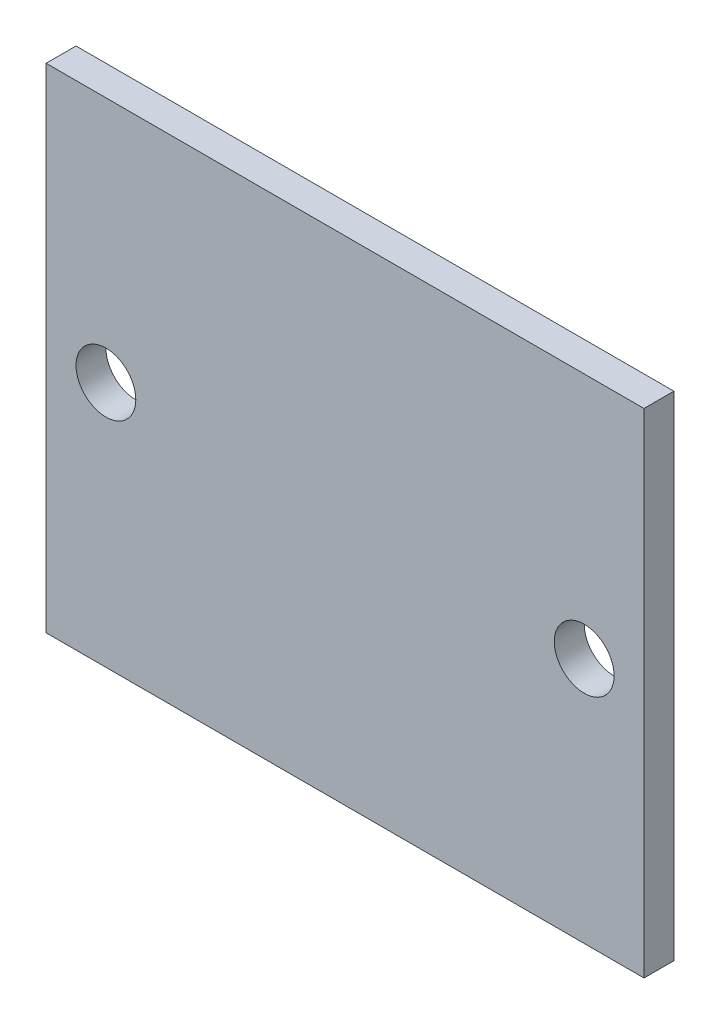
ISO-10303-21;
HEADER;
FILE_DESCRIPTION(('STEP AP214'),'2;1');
FILE_NAME('part.step','',(''),(''),'','','');
FILE_SCHEMA(('AUTOMOTIVE_DESIGN { 1 0 10303 214 1 1 1 1 }'));
ENDSEC;
DATA;
#1=APPLICATION_CONTEXT('core data for automotive mechanical design processes');
#2=APPLICATION_PROTOCOL_DEFINITION('international standard','automotive_design',2000,#1);
#3=PRODUCT_CONTEXT('',#1,'mechanical');
#4=PRODUCT('Part','Part','',(#3));
#5=PRODUCT_RELATED_PRODUCT_CATEGORY('part','',(#4));
#6=PRODUCT_DEFINITION_FORMATION('','',#4);
#7=PRODUCT_DEFINITION_CONTEXT('part definition',#1,'design');
#8=PRODUCT_DEFINITION('design','',#6,#7);
#9=PRODUCT_DEFINITION_SHAPE('','',#8);
#10=(LENGTH_UNIT() NAMED_UNIT(*) SI_UNIT(.MILLI.,.METRE.));
#11=(NAMED_UNIT(*) PLANE_ANGLE_UNIT() SI_UNIT($,.RADIAN.));
#12=(NAMED_UNIT(*) SI_UNIT($,.STERADIAN.) SOLID_ANGLE_UNIT());
#13=UNCERTAINTY_MEASURE_WITH_UNIT(LENGTH_MEASURE(1.E-05),#10,'distance_accuracy_value','');
#14=(GEOMETRIC_REPRESENTATION_CONTEXT(3) GLOBAL_UNCERTAINTY_ASSIGNED_CONTEXT((#13)) GLOBAL_UNIT_ASSIGNED_CONTEXT((#10,
#11,#12)) REPRESENTATION_CONTEXT('',''));
#15=CARTESIAN_POINT('',(0.,0.,0.));
#16=DIRECTION('',(0.,0.,1.));
#17=DIRECTION('',(1.,0.,0.));
#18=AXIS2_PLACEMENT_3D('',#15,#16,#17);
#19=CARTESIAN_POINT('',(-10.,8.25,1.));
#20=DIRECTION('',(1.,0.,0.));
#21=DIRECTION('',(0.,1.,0.));
#22=AXIS2_PLACEMENT_3D('',#19,#20,#21);
#23=PLANE('',#22);
#24=DIRECTION('',(0.,-1.,0.));
#25=VECTOR('',#24,1.);
#26=CARTESIAN_POINT('',(-10.,8.25,0.));
#27=LINE('',#26,#25);
#28=CARTESIAN_POINT('',(-10.,8.25,0.));
#29=VERTEX_POINT('',#28);
#30=CARTESIAN_POINT('',(-10.,-8.25,0.));
#31=VERTEX_POINT('',#30);
#32=EDGE_CURVE('E96',#29,#31,#27,.T.);
#33=ORIENTED_EDGE('',*,*,#32,.T.);
#34=DIRECTION('',(0.,0.,-1.));
#35=VECTOR('',#34,1.);
#36=CARTESIAN_POINT('',(-10.,-8.25,1.));
#37=LINE('',#36,#35);
#38=CARTESIAN_POINT('',(-10.,-8.25,1.));
#39=VERTEX_POINT('',#38);
#40=EDGE_CURVE('E11',#39,#31,#37,.T.);
#41=ORIENTED_EDGE('',*,*,#40,.F.);
#42=DIRECTION('',(0.,-1.,0.));
#43=VECTOR('',#42,1.);
#44=CARTESIAN_POINT('',(-10.,8.25,1.));
#45=LINE('',#44,#43);
#46=CARTESIAN_POINT('',(-10.,8.25,1.));
#47=VERTEX_POINT('',#46);
#48=EDGE_CURVE('E84',#47,#39,#45,.T.);
#49=ORIENTED_EDGE('',*,*,#48,.F.);
#50=DIRECTION('',(0.,0.,-1.));
#51=VECTOR('',#50,1.);
#52=CARTESIAN_POINT('',(-10.,8.25,1.));
#53=LINE('',#52,#51);
#54=EDGE_CURVE('E92',#47,#29,#53,.T.);
#55=ORIENTED_EDGE('',*,*,#54,.T.);
#56=EDGE_LOOP('',(#33,#41,#49,#55));
#57=FACE_BOUND('',#56,.T.);
#58=ADVANCED_FACE('F33',(#57),#23,.F.);
#59=CARTESIAN_POINT('',(-10.,-8.25,1.));
#60=DIRECTION('',(0.,1.,0.));
#61=DIRECTION('',(0.,0.,1.));
#62=AXIS2_PLACEMENT_3D('',#59,#60,#61);
#63=PLANE('',#62);
#64=DIRECTION('',(1.,0.,0.));
#65=VECTOR('',#64,1.);
#66=CARTESIAN_POINT('',(-10.,-8.25,0.));
#67=LINE('',#66,#65);
#68=CARTESIAN_POINT('',(10.,-8.25,0.));
#69=VERTEX_POINT('',#68);
#70=EDGE_CURVE('E88',#31,#69,#67,.T.);
#71=ORIENTED_EDGE('',*,*,#70,.T.);
#72=DIRECTION('',(0.,0.,-1.));
#73=VECTOR('',#72,1.);
#74=CARTESIAN_POINT('',(10.,-8.25,1.));
#75=LINE('',#74,#73);
#76=CARTESIAN_POINT('',(10.,-8.25,1.));
#77=VERTEX_POINT('',#76);
#78=EDGE_CURVE('E41',#77,#69,#75,.T.);
#79=ORIENTED_EDGE('',*,*,#78,.F.);
#80=DIRECTION('',(1.,0.,0.));
#81=VECTOR('',#80,1.);
#82=CARTESIAN_POINT('',(-10.,-8.25,1.));
#83=LINE('',#82,#81);
#84=EDGE_CURVE('E79',#39,#77,#83,.T.);
#85=ORIENTED_EDGE('',*,*,#84,.F.);
#86=ORIENTED_EDGE('',*,*,#40,.T.);
#87=EDGE_LOOP('',(#71,#79,#85,#86));
#88=FACE_BOUND('',#87,.T.);
#89=ADVANCED_FACE('F87',(#88),#63,.F.);
#90=CARTESIAN_POINT('',(10.,8.25,1.));
#91=DIRECTION('',(-1.,0.,0.));
#92=DIRECTION('',(0.,-1.,0.));
#93=AXIS2_PLACEMENT_3D('',#90,#91,#92);
#94=PLANE('',#93);
#95=DIRECTION('',(0.,1.,0.));
#96=VECTOR('',#95,1.);
#97=CARTESIAN_POINT('',(10.,8.25,0.));
#98=LINE('',#97,#96);
#99=CARTESIAN_POINT('',(10.,8.25,0.));
#100=VERTEX_POINT('',#99);
#101=EDGE_CURVE('E66',#69,#100,#98,.T.);
#102=ORIENTED_EDGE('',*,*,#101,.T.);
#103=DIRECTION('',(0.,0.,-1.));
#104=VECTOR('',#103,1.);
#105=CARTESIAN_POINT('',(10.,8.25,1.));
#106=LINE('',#105,#104);
#107=CARTESIAN_POINT('',(10.,8.25,1.));
#108=VERTEX_POINT('',#107);
#109=EDGE_CURVE('E89',#108,#100,#106,.T.);
#110=ORIENTED_EDGE('',*,*,#109,.F.);
#111=DIRECTION('',(0.,1.,0.));
#112=VECTOR('',#111,1.);
#113=CARTESIAN_POINT('',(10.,8.25,1.));
#114=LINE('',#113,#112);
#115=EDGE_CURVE('E82',#77,#108,#114,.T.);
#116=ORIENTED_EDGE('',*,*,#115,.F.);
#117=ORIENTED_EDGE('',*,*,#78,.T.);
#118=EDGE_LOOP('',(#102,#110,#116,#117));
#119=FACE_BOUND('',#118,.T.);
#120=ADVANCED_FACE('F90',(#119),#94,.F.);
#121=CARTESIAN_POINT('',(-10.,8.25,1.));
#122=DIRECTION('',(0.,-1.,0.));
#123=DIRECTION('',(1.,0.,0.));
#124=AXIS2_PLACEMENT_3D('',#121,#122,#123);
#125=PLANE('',#124);
#126=DIRECTION('',(-1.,0.,0.));
#127=VECTOR('',#126,1.);
#128=CARTESIAN_POINT('',(-10.,8.25,0.));
#129=LINE('',#128,#127);
#130=EDGE_CURVE('E72',#100,#29,#129,.T.);
#131=ORIENTED_EDGE('',*,*,#130,.T.);
#132=ORIENTED_EDGE('',*,*,#54,.F.);
#133=DIRECTION('',(-1.,0.,0.));
#134=VECTOR('',#133,1.);
#135=CARTESIAN_POINT('',(-10.,8.25,1.));
#136=LINE('',#135,#134);
#137=EDGE_CURVE('E49',#108,#47,#136,.T.);
#138=ORIENTED_EDGE('',*,*,#137,.F.);
#139=ORIENTED_EDGE('',*,*,#109,.T.);
#140=EDGE_LOOP('',(#131,#132,#138,#139));
#141=FACE_BOUND('',#140,.T.);
#142=ADVANCED_FACE('F104',(#141),#125,.F.);
#143=CARTESIAN_POINT('',(0.,0.,1.));
#144=DIRECTION('',(0.,0.,1.));
#145=DIRECTION('',(1.,0.,0.));
#146=AXIS2_PLACEMENT_3D('',#143,#144,#145);
#147=PLANE('',#146);
#148=CARTESIAN_POINT('',(8.,0.,1.));
#149=DIRECTION('',(0.,0.,1.));
#150=DIRECTION('',(1.,0.,0.));
#151=AXIS2_PLACEMENT_3D('',#148,#149,#150);
#152=CIRCLE('',#151,1.);
#153=CARTESIAN_POINT('',(9.,0.,1.));
#154=VERTEX_POINT('',#153);
#155=EDGE_CURVE('E116',#154,#154,#152,.T.);
#156=ORIENTED_EDGE('',*,*,#155,.F.);
#157=EDGE_LOOP('',(#156));
#158=FACE_BOUND('',#157,.T.);
#159=CARTESIAN_POINT('',(-8.,0.,1.));
#160=DIRECTION('',(0.,0.,1.));
#161=DIRECTION('',(1.,0.,0.));
#162=AXIS2_PLACEMENT_3D('',#159,#160,#161);
#163=CIRCLE('',#162,1.);
#164=CARTESIAN_POINT('',(-7.,0.,1.));
#165=VERTEX_POINT('',#164);
#166=EDGE_CURVE('E110',#165,#165,#163,.T.);
#167=ORIENTED_EDGE('',*,*,#166,.F.);
#168=EDGE_LOOP('',(#167));
#169=FACE_BOUND('',#168,.T.);
#170=ORIENTED_EDGE('',*,*,#48,.T.);
#171=ORIENTED_EDGE('',*,*,#84,.T.);
#172=ORIENTED_EDGE('',*,*,#115,.T.);
#173=ORIENTED_EDGE('',*,*,#137,.T.);
#174=EDGE_LOOP('',(#170,#171,#172,#173));
#175=FACE_BOUND('',#174,.T.);
#176=ADVANCED_FACE('F80',(#158,#169,#175),#147,.T.);
#177=CARTESIAN_POINT('',(0.,0.,0.));
#178=DIRECTION('',(0.,0.,1.));
#179=DIRECTION('',(1.,0.,0.));
#180=AXIS2_PLACEMENT_3D('',#177,#178,#179);
#181=PLANE('',#180);
#182=CARTESIAN_POINT('',(8.,0.,0.));
#183=DIRECTION('',(0.,0.,1.));
#184=DIRECTION('',(1.,0.,0.));
#185=AXIS2_PLACEMENT_3D('',#182,#183,#184);
#186=CIRCLE('',#185,1.);
#187=CARTESIAN_POINT('',(9.,0.,0.));
#188=VERTEX_POINT('',#187);
#189=EDGE_CURVE('E113',#188,#188,#186,.T.);
#190=ORIENTED_EDGE('',*,*,#189,.T.);
#191=EDGE_LOOP('',(#190));
#192=FACE_BOUND('',#191,.T.);
#193=CARTESIAN_POINT('',(-8.,0.,0.));
#194=DIRECTION('',(0.,0.,1.));
#195=DIRECTION('',(1.,0.,0.));
#196=AXIS2_PLACEMENT_3D('',#193,#194,#195);
#197=CIRCLE('',#196,1.);
#198=CARTESIAN_POINT('',(-7.,0.,0.));
#199=VERTEX_POINT('',#198);
#200=EDGE_CURVE('E99',#199,#199,#197,.T.);
#201=ORIENTED_EDGE('',*,*,#200,.T.);
#202=EDGE_LOOP('',(#201));
#203=FACE_BOUND('',#202,.T.);
#204=ORIENTED_EDGE('',*,*,#32,.F.);
#205=ORIENTED_EDGE('',*,*,#130,.F.);
#206=ORIENTED_EDGE('',*,*,#101,.F.);
#207=ORIENTED_EDGE('',*,*,#70,.F.);
#208=EDGE_LOOP('',(#204,#205,#206,#207));
#209=FACE_BOUND('',#208,.T.);
#210=ADVANCED_FACE('F107',(#192,#203,#209),#181,.F.);
#211=CARTESIAN_POINT('',(-8.,0.,0.));
#212=DIRECTION('',(0.,0.,1.));
#213=DIRECTION('',(1.,0.,0.));
#214=AXIS2_PLACEMENT_3D('',#211,#212,#213);
#215=CYLINDRICAL_SURFACE('',#214,1.);
#216=ORIENTED_EDGE('',*,*,#200,.F.);
#217=EDGE_LOOP('',(#216));
#218=FACE_BOUND('',#217,.T.);
#219=ORIENTED_EDGE('',*,*,#166,.T.);
#220=EDGE_LOOP('',(#219));
#221=FACE_BOUND('',#220,.T.);
#222=ADVANCED_FACE('F127',(#218,#221),#215,.F.);
#223=CARTESIAN_POINT('',(8.,0.,0.));
#224=DIRECTION('',(0.,0.,1.));
#225=DIRECTION('',(1.,0.,0.));
#226=AXIS2_PLACEMENT_3D('',#223,#224,#225);
#227=CYLINDRICAL_SURFACE('',#226,1.);
#228=ORIENTED_EDGE('',*,*,#189,.F.);
#229=EDGE_LOOP('',(#228));
#230=FACE_BOUND('',#229,.T.);
#231=ORIENTED_EDGE('',*,*,#155,.T.);
#232=EDGE_LOOP('',(#231));
#233=FACE_BOUND('',#232,.T.);
#234=ADVANCED_FACE('F124',(#230,#233),#227,.F.);
#235=CLOSED_SHELL('',(#58,#89,#120,#142,#176,#210,#222,#234));
#236=MANIFOLD_SOLID_BREP('B2',#235);
#237=ADVANCED_BREP_SHAPE_REPRESENTATION('',(#18,#236),#14);
#238=SHAPE_DEFINITION_REPRESENTATION(#9,#237);
ENDSEC;
END-ISO-10303-21;
